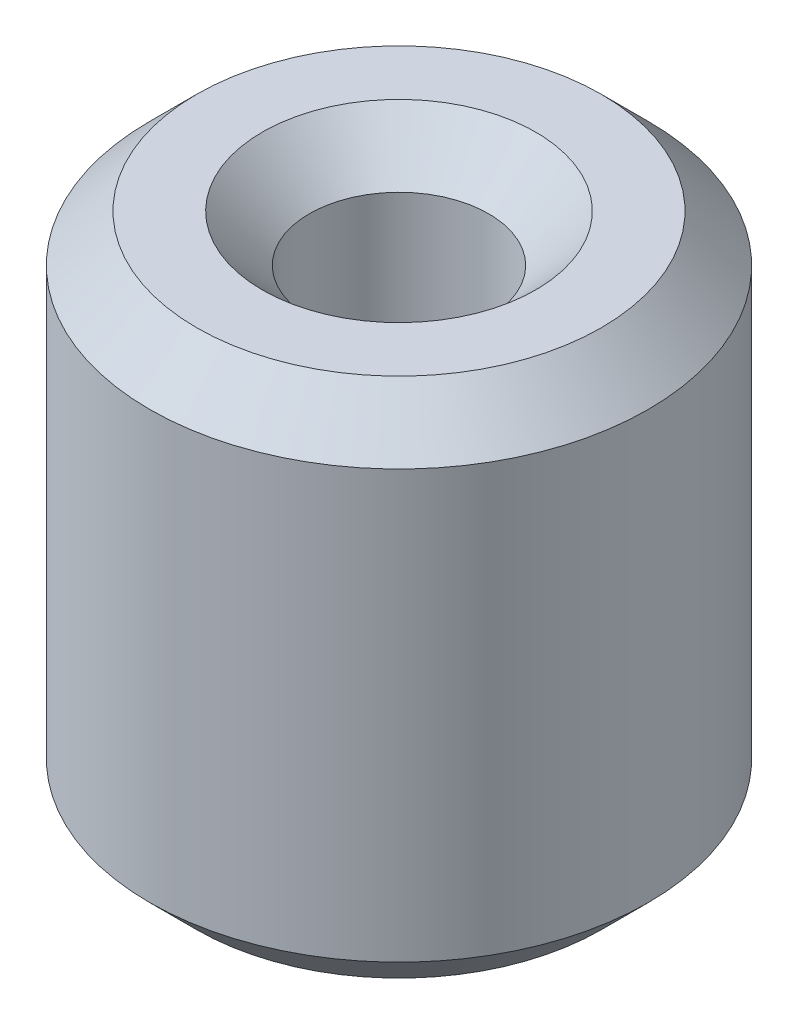
ISO-10303-21;
HEADER;
FILE_DESCRIPTION(('STEP AP214'),'2;1');
FILE_NAME('part.step','',(''),(''),'','','');
FILE_SCHEMA(('AUTOMOTIVE_DESIGN { 1 0 10303 214 1 1 1 1 }'));
ENDSEC;
DATA;
#1=APPLICATION_CONTEXT('core data for automotive mechanical design processes');
#2=APPLICATION_PROTOCOL_DEFINITION('international standard','automotive_design',2000,#1);
#3=PRODUCT_CONTEXT('',#1,'mechanical');
#4=PRODUCT('Part','Part','',(#3));
#5=PRODUCT_RELATED_PRODUCT_CATEGORY('part','',(#4));
#6=PRODUCT_DEFINITION_FORMATION('','',#4);
#7=PRODUCT_DEFINITION_CONTEXT('part definition',#1,'design');
#8=PRODUCT_DEFINITION('design','',#6,#7);
#9=PRODUCT_DEFINITION_SHAPE('','',#8);
#10=(LENGTH_UNIT() NAMED_UNIT(*) SI_UNIT(.MILLI.,.METRE.));
#11=(NAMED_UNIT(*) PLANE_ANGLE_UNIT() SI_UNIT($,.RADIAN.));
#12=(NAMED_UNIT(*) SI_UNIT($,.STERADIAN.) SOLID_ANGLE_UNIT());
#13=UNCERTAINTY_MEASURE_WITH_UNIT(LENGTH_MEASURE(1.E-05),#10,'distance_accuracy_value','');
#14=(GEOMETRIC_REPRESENTATION_CONTEXT(3) GLOBAL_UNCERTAINTY_ASSIGNED_CONTEXT((#13)) GLOBAL_UNIT_ASSIGNED_CONTEXT((#10,
#11,#12)) REPRESENTATION_CONTEXT('',''));
#15=CARTESIAN_POINT('',(0.,0.,0.));
#16=DIRECTION('',(0.,0.,1.));
#17=DIRECTION('',(1.,0.,0.));
#18=AXIS2_PLACEMENT_3D('',#15,#16,#17);
#19=CARTESIAN_POINT('',(0.,20.9052138757067,0.));
#20=DIRECTION('',(0.,-1.,0.));
#21=DIRECTION('',(0.,0.,-1.));
#22=AXIS2_PLACEMENT_3D('',#19,#20,#21);
#23=CYLINDRICAL_SURFACE('',#22,10.);
#24=CARTESIAN_POINT('',(0.,1.88904511350222,0.));
#25=DIRECTION('',(0.,1.,0.));
#26=DIRECTION('',(0.,0.,1.));
#27=AXIS2_PLACEMENT_3D('',#24,#25,#26);
#28=CIRCLE('',#27,10.);
#29=CARTESIAN_POINT('',(0.,1.88904511350222,10.));
#30=VERTEX_POINT('',#29);
#31=EDGE_CURVE('E10',#30,#30,#28,.T.);
#32=ORIENTED_EDGE('',*,*,#31,.T.);
#33=EDGE_LOOP('',(#32));
#34=FACE_BOUND('',#33,.T.);
#35=CARTESIAN_POINT('',(0.,19.0161687622044,0.));
#36=DIRECTION('',(0.,1.,0.));
#37=DIRECTION('',(0.,0.,1.));
#38=AXIS2_PLACEMENT_3D('',#35,#36,#37);
#39=CIRCLE('',#38,10.);
#40=CARTESIAN_POINT('',(0.,19.0161687622044,-10.));
#41=VERTEX_POINT('',#40);
#42=EDGE_CURVE('E50',#41,#41,#39,.F.);
#43=ORIENTED_EDGE('',*,*,#42,.T.);
#44=EDGE_LOOP('',(#43));
#45=FACE_BOUND('',#44,.T.);
#46=ADVANCED_FACE('F39',(#34,#45),#23,.T.);
#47=CARTESIAN_POINT('',(0.,20.9052138757067,0.));
#48=DIRECTION('',(0.,1.,0.));
#49=DIRECTION('',(0.,0.,1.));
#50=AXIS2_PLACEMENT_3D('',#47,#48,#49);
#51=PLANE('',#50);
#52=CARTESIAN_POINT('',(0.,20.9052138757067,0.));
#53=DIRECTION('',(0.,1.,0.));
#54=DIRECTION('',(0.,0.,1.));
#55=AXIS2_PLACEMENT_3D('',#52,#53,#54);
#56=CIRCLE('',#55,5.48269307298331);
#57=CARTESIAN_POINT('',(0.,20.9052138757067,5.48269307298331));
#58=VERTEX_POINT('',#57);
#59=EDGE_CURVE('E58',#58,#58,#56,.F.);
#60=ORIENTED_EDGE('',*,*,#59,.T.);
#61=EDGE_LOOP('',(#60));
#62=FACE_BOUND('',#61,.T.);
#63=CARTESIAN_POINT('',(0.,20.9052138757067,0.));
#64=DIRECTION('',(0.,1.,0.));
#65=DIRECTION('',(0.,0.,1.));
#66=AXIS2_PLACEMENT_3D('',#63,#64,#65);
#67=CIRCLE('',#66,8.11095488649778);
#68=CARTESIAN_POINT('',(0.,20.9052138757066,-8.11095488649779));
#69=VERTEX_POINT('',#68);
#70=EDGE_CURVE('E61',#69,#69,#67,.T.);
#71=ORIENTED_EDGE('',*,*,#70,.T.);
#72=EDGE_LOOP('',(#71));
#73=FACE_BOUND('',#72,.T.);
#74=ADVANCED_FACE('F88',(#62,#73),#51,.T.);
#75=CARTESIAN_POINT('',(0.,0.,0.));
#76=DIRECTION('',(0.,1.,0.));
#77=DIRECTION('',(0.,0.,1.));
#78=AXIS2_PLACEMENT_3D('',#75,#76,#77);
#79=PLANE('',#78);
#80=CARTESIAN_POINT('',(0.,0.,0.));
#81=DIRECTION('',(0.,1.,0.));
#82=DIRECTION('',(0.,0.,1.));
#83=AXIS2_PLACEMENT_3D('',#80,#81,#82);
#84=CIRCLE('',#83,5.4826930729833);
#85=CARTESIAN_POINT('',(0.,0.,5.4826930729833));
#86=VERTEX_POINT('',#85);
#87=EDGE_CURVE('E51',#86,#86,#84,.T.);
#88=ORIENTED_EDGE('',*,*,#87,.T.);
#89=EDGE_LOOP('',(#88));
#90=FACE_BOUND('',#89,.T.);
#91=CARTESIAN_POINT('',(0.,0.,0.));
#92=DIRECTION('',(0.,1.,0.));
#93=DIRECTION('',(0.,0.,1.));
#94=AXIS2_PLACEMENT_3D('',#91,#92,#93);
#95=CIRCLE('',#94,8.11095488649777);
#96=CARTESIAN_POINT('',(0.,0.,8.11095488649777));
#97=VERTEX_POINT('',#96);
#98=EDGE_CURVE('E54',#97,#97,#95,.F.);
#99=ORIENTED_EDGE('',*,*,#98,.T.);
#100=EDGE_LOOP('',(#99));
#101=FACE_BOUND('',#100,.T.);
#102=ADVANCED_FACE('F83',(#90,#101),#79,.F.);
#103=CARTESIAN_POINT('',(0.,20.9052138757067,0.));
#104=DIRECTION('',(0.,-1.,0.));
#105=DIRECTION('',(0.,0.,-1.));
#106=AXIS2_PLACEMENT_3D('',#103,#104,#105);
#107=CYLINDRICAL_SURFACE('',#106,3.59364795948108);
#108=CARTESIAN_POINT('',(0.,19.0161687622044,0.));
#109=DIRECTION('',(0.,1.,0.));
#110=DIRECTION('',(0.,0.,1.));
#111=AXIS2_PLACEMENT_3D('',#108,#109,#110);
#112=CIRCLE('',#111,3.59364795948108);
#113=CARTESIAN_POINT('',(0.,19.0161687622044,3.59364795948107));
#114=VERTEX_POINT('',#113);
#115=EDGE_CURVE('E67',#114,#114,#112,.T.);
#116=ORIENTED_EDGE('',*,*,#115,.T.);
#117=EDGE_LOOP('',(#116));
#118=FACE_BOUND('',#117,.T.);
#119=CARTESIAN_POINT('',(0.,1.88904511350223,0.));
#120=DIRECTION('',(0.,1.,0.));
#121=DIRECTION('',(0.,0.,1.));
#122=AXIS2_PLACEMENT_3D('',#119,#120,#121);
#123=CIRCLE('',#122,3.59364795948108);
#124=CARTESIAN_POINT('',(0.,1.88904511350223,3.59364795948108));
#125=VERTEX_POINT('',#124);
#126=EDGE_CURVE('E69',#125,#125,#123,.F.);
#127=ORIENTED_EDGE('',*,*,#126,.T.);
#128=EDGE_LOOP('',(#127));
#129=FACE_BOUND('',#128,.T.);
#130=ADVANCED_FACE('F71',(#118,#129),#107,.F.);
#131=CARTESIAN_POINT('',(0.,19.0161687622044,0.));
#132=DIRECTION('',(0.,1.,0.));
#133=DIRECTION('',(0.,0.,1.));
#134=AXIS2_PLACEMENT_3D('',#131,#132,#133);
#135=CONICAL_SURFACE('',#134,3.59364795948108,0.785398163397452);
#136=CARTESIAN_POINT('',(0.,20.9052138757067,5.48269307298331));
#137=CARTESIAN_POINT('',(0.,20.885536322441,5.46301551971766));
#138=CARTESIAN_POINT('',(0.,20.8658587691754,5.44333796645202));
#139=CARTESIAN_POINT('',(0.,20.8265036626441,5.40398285992072));
#140=CARTESIAN_POINT('',(0.,20.8068261093784,5.38430530665507));
#141=CARTESIAN_POINT('',(0.,20.7674710028471,5.34495020012377));
#142=CARTESIAN_POINT('',(0.,20.7477934495815,5.32527264685813));
#143=CARTESIAN_POINT('',(0.,20.7084383430502,5.28591754032683));
#144=CARTESIAN_POINT('',(0.,20.6887607897845,5.26623998706118));
#145=CARTESIAN_POINT('',(0.,20.6494056832532,5.22688488052988));
#146=CARTESIAN_POINT('',(0.,20.6297281299876,5.20720732726424));
#147=CARTESIAN_POINT('',(0.,20.5903730234563,5.16785222073294));
#148=CARTESIAN_POINT('',(0.,20.5706954701906,5.14817466746729));
#149=CARTESIAN_POINT('',(0.,20.5313403636593,5.10881956093599));
#150=CARTESIAN_POINT('',(0.,20.5116628103937,5.08914200767035));
#151=CARTESIAN_POINT('',(0.,20.4723077038624,5.04978690113905));
#152=CARTESIAN_POINT('',(0.,20.4526301505967,5.0301093478734));
#153=CARTESIAN_POINT('',(0.,20.4132750440654,4.99075424134211));
#154=CARTESIAN_POINT('',(0.,20.3935974907998,4.97107668807646));
#155=CARTESIAN_POINT('',(0.,20.3542423842685,4.93172158154516));
#156=CARTESIAN_POINT('',(0.,20.3345648310029,4.91204402827951));
#157=CARTESIAN_POINT('',(0.,20.2952097244716,4.87268892174821));
#158=CARTESIAN_POINT('',(0.,20.2755321712059,4.85301136848257));
#159=CARTESIAN_POINT('',(0.,20.2361770646746,4.81365626195127));
#160=CARTESIAN_POINT('',(0.,20.216499511409,4.79397870868562));
#161=CARTESIAN_POINT('',(0.,20.1771444048777,4.75462360215433));
#162=CARTESIAN_POINT('',(0.,20.157466851612,4.73494604888868));
#163=CARTESIAN_POINT('',(0.,20.1181117450807,4.69559094235738));
#164=CARTESIAN_POINT('',(0.,20.0984341918151,4.67591338909173));
#165=CARTESIAN_POINT('',(0.,20.0590790852838,4.63655828256043));
#166=CARTESIAN_POINT('',(0.,20.0394015320181,4.61688072929479));
#167=CARTESIAN_POINT('',(0.,20.0000464254868,4.57752562276349));
#168=CARTESIAN_POINT('',(0.,19.9803688722212,4.55784806949784));
#169=CARTESIAN_POINT('',(0.,19.9410137656899,4.51849296296654));
#170=CARTESIAN_POINT('',(0.,19.9213362124242,4.4988154097009));
#171=CARTESIAN_POINT('',(0.,19.8819811058929,4.4594603031696));
#172=CARTESIAN_POINT('',(0.,19.8623035526273,4.43978274990395));
#173=CARTESIAN_POINT('',(0.,19.822948446096,4.40042764337266));
#174=CARTESIAN_POINT('',(0.,19.8032708928303,4.38075009010701));
#175=CARTESIAN_POINT('',(0.,19.7639157862991,4.34139498357571));
#176=CARTESIAN_POINT('',(0.,19.7442382330334,4.32171743031006));
#177=CARTESIAN_POINT('',(0.,19.7048831265021,4.28236232377877));
#178=CARTESIAN_POINT('',(0.,19.6852055732365,4.26268477051312));
#179=CARTESIAN_POINT('',(0.,19.6458504667052,4.22332966398182));
#180=CARTESIAN_POINT('',(0.,19.6261729134395,4.20365211071617));
#181=CARTESIAN_POINT('',(0.,19.5868178069082,4.16429700418488));
#182=CARTESIAN_POINT('',(0.,19.5671402536426,4.14461945091923));
#183=CARTESIAN_POINT('',(0.,19.5277851471113,4.10526434438793));
#184=CARTESIAN_POINT('',(0.,19.5081075938456,4.08558679112228));
#185=CARTESIAN_POINT('',(0.,19.4687524873143,4.04623168459099));
#186=CARTESIAN_POINT('',(0.,19.4490749340487,4.02655413132534));
#187=CARTESIAN_POINT('',(0.,19.4097198275174,3.98719902479404));
#188=CARTESIAN_POINT('',(0.,19.3900422742517,3.96752147152839));
#189=CARTESIAN_POINT('',(0.,19.3506871677204,3.9281663649971));
#190=CARTESIAN_POINT('',(0.,19.3310096144548,3.90848881173145));
#191=CARTESIAN_POINT('',(0.,19.2916545079235,3.86913370520015));
#192=CARTESIAN_POINT('',(0.,19.2719769546578,3.8494561519345));
#193=CARTESIAN_POINT('',(0.,19.2326218481266,3.81010104540321));
#194=CARTESIAN_POINT('',(0.,19.2129442948609,3.79042349213756));
#195=CARTESIAN_POINT('',(0.,19.1735891883296,3.75106838560626));
#196=CARTESIAN_POINT('',(0.,19.153911635064,3.73139083234061));
#197=CARTESIAN_POINT('',(0.,19.1145565285327,3.69203572580932));
#198=CARTESIAN_POINT('',(0.,19.094878975267,3.67235817254367));
#199=CARTESIAN_POINT('',(0.,19.0555238687357,3.63300306601237));
#200=CARTESIAN_POINT('',(0.,19.0358463154701,3.61332551274672));
#201=CARTESIAN_POINT('',(0.,19.0161687622044,3.59364795948107));
#202=B_SPLINE_CURVE_WITH_KNOTS('',3,(#136,#137,#138,#139,#140,#141,#142,#143,#144,#145,#146,
#147,#148,#149,#150,#151,#152,#153,#154,#155,#156,#157,#158,#159,#160,#161,#162,#163,#164,#165,
#166,#167,#168,#169,#170,#171,#172,#173,#174,#175,#176,#177,#178,#179,#180,#181,#182,#183,#184,
#185,#186,#187,#188,#189,#190,#191,#192,#193,#194,#195,#196,#197,#198,#199,#200,#201),
.UNSPECIFIED.,.F.,.F.,(4,2,2,2,2,2,2,2,2,2,2,2,2,2,2,2,2,2,2,2,2,2,2,2,2,2,2,2,2,2,2,2,4),(0.,
0.0834847881077979,0.166969576215593,0.250454364323391,0.333939152431186,0.417423940538981,
0.500908728646779,0.584393516754575,0.667878304862369,0.751363092970167,0.834847881077963,
0.918332669185758,1.00181745729356,1.08530224540135,1.16878703350915,1.25227182161694,
1.33575660972474,1.41924139783254,1.50272618594033,1.58621097404813,1.66969576215592,
1.75318055026372,1.83666533837152,1.92015012647931,2.00363491458711,2.0871197026949,
2.1706044908027,2.2540892789105,2.33757406701829,2.42105885512609,2.50454364323389,
2.58802843134168,2.67151321944948),.UNSPECIFIED.);
#203=EDGE_CURVE('BSEAM77',#58,#114,#202,.T.);
#204=ORIENTED_EDGE('',*,*,#59,.F.);
#205=ORIENTED_EDGE('',*,*,#115,.F.);
#206=ORIENTED_EDGE('',*,*,#203,.T.);
#207=ORIENTED_EDGE('',*,*,#203,.F.);
#208=EDGE_LOOP('',(#204,#206,#205,#207));
#209=FACE_BOUND('',#208,.T.);
#210=ADVANCED_FACE('F77',(#209),#135,.F.);
#211=CARTESIAN_POINT('',(0.,0.,0.));
#212=DIRECTION('',(0.,-1.,0.));
#213=DIRECTION('',(0.,0.,-1.));
#214=AXIS2_PLACEMENT_3D('',#211,#212,#213);
#215=CONICAL_SURFACE('',#214,5.4826930729833,0.785398163397446);
#216=ORIENTED_EDGE('',*,*,#126,.F.);
#217=EDGE_LOOP('',(#216));
#218=FACE_BOUND('',#217,.T.);
#219=ORIENTED_EDGE('',*,*,#87,.F.);
#220=EDGE_LOOP('',(#219));
#221=FACE_BOUND('',#220,.T.);
#222=ADVANCED_FACE('F73',(#218,#221),#215,.F.);
#223=CARTESIAN_POINT('',(0.,1.88904511350222,0.));
#224=DIRECTION('',(0.,1.,0.));
#225=DIRECTION('',(0.,0.,1.));
#226=AXIS2_PLACEMENT_3D('',#223,#224,#225);
#227=CONICAL_SURFACE('',#226,10.,0.785398163397451);
#228=ORIENTED_EDGE('',*,*,#98,.F.);
#229=EDGE_LOOP('',(#228));
#230=FACE_BOUND('',#229,.T.);
#231=ORIENTED_EDGE('',*,*,#31,.F.);
#232=EDGE_LOOP('',(#231));
#233=FACE_BOUND('',#232,.T.);
#234=ADVANCED_FACE('F76',(#230,#233),#227,.T.);
#235=CARTESIAN_POINT('',(0.,20.9052138757067,0.));
#236=DIRECTION('',(0.,-1.,0.));
#237=DIRECTION('',(0.,0.,-1.));
#238=AXIS2_PLACEMENT_3D('',#235,#236,#237);
#239=CONICAL_SURFACE('',#238,8.11095488649778,0.785398163397447);
#240=CARTESIAN_POINT('',(0.,19.0161687622044,-10.));
#241=CARTESIAN_POINT('',(0.,19.0358463154701,-9.98032244673436));
#242=CARTESIAN_POINT('',(0.,19.0555238687357,-9.96064489346871));
#243=CARTESIAN_POINT('',(0.,19.094878975267,-9.92128978693741));
#244=CARTESIAN_POINT('',(0.,19.1145565285327,-9.90161223367176));
#245=CARTESIAN_POINT('',(0.,19.153911635064,-9.86225712714047));
#246=CARTESIAN_POINT('',(0.,19.1735891883296,-9.84257957387482));
#247=CARTESIAN_POINT('',(0.,19.2129442948609,-9.80322446734352));
#248=CARTESIAN_POINT('',(0.,19.2326218481266,-9.78354691407788));
#249=CARTESIAN_POINT('',(0.,19.2719769546578,-9.74419180754658));
#250=CARTESIAN_POINT('',(0.,19.2916545079235,-9.72451425428093));
#251=CARTESIAN_POINT('',(0.,19.3310096144548,-9.68515914774963));
#252=CARTESIAN_POINT('',(0.,19.3506871677204,-9.66548159448399));
#253=CARTESIAN_POINT('',(0.,19.3900422742517,-9.62612648795269));
#254=CARTESIAN_POINT('',(0.,19.4097198275174,-9.60644893468704));
#255=CARTESIAN_POINT('',(0.,19.4490749340487,-9.56709382815575));
#256=CARTESIAN_POINT('',(0.,19.4687524873143,-9.5474162748901));
#257=CARTESIAN_POINT('',(0.,19.5081075938456,-9.5080611683588));
#258=CARTESIAN_POINT('',(0.,19.5277851471113,-9.48838361509315));
#259=CARTESIAN_POINT('',(0.,19.5671402536426,-9.44902850856186));
#260=CARTESIAN_POINT('',(0.,19.5868178069082,-9.42935095529621));
#261=CARTESIAN_POINT('',(0.,19.6261729134395,-9.38999584876491));
#262=CARTESIAN_POINT('',(0.,19.6458504667052,-9.37031829549927));
#263=CARTESIAN_POINT('',(0.,19.6852055732365,-9.33096318896797));
#264=CARTESIAN_POINT('',(0.,19.7048831265021,-9.31128563570232));
#265=CARTESIAN_POINT('',(0.,19.7442382330334,-9.27193052917102));
#266=CARTESIAN_POINT('',(0.,19.7639157862991,-9.25225297590538));
#267=CARTESIAN_POINT('',(0.,19.8032708928303,-9.21289786937408));
#268=CARTESIAN_POINT('',(0.,19.822948446096,-9.19322031610843));
#269=CARTESIAN_POINT('',(0.,19.8623035526273,-9.15386520957714));
#270=CARTESIAN_POINT('',(0.,19.8819811058929,-9.13418765631149));
#271=CARTESIAN_POINT('',(0.,19.9213362124242,-9.09483254978019));
#272=CARTESIAN_POINT('',(0.,19.9410137656899,-9.07515499651454));
#273=CARTESIAN_POINT('',(0.,19.9803688722212,-9.03579988998325));
#274=CARTESIAN_POINT('',(0.,20.0000464254868,-9.0161223367176));
#275=CARTESIAN_POINT('',(0.,20.0394015320181,-8.9767672301863));
#276=CARTESIAN_POINT('',(0.,20.0590790852838,-8.95708967692066));
#277=CARTESIAN_POINT('',(0.,20.0984341918151,-8.91773457038936));
#278=CARTESIAN_POINT('',(0.,20.1181117450807,-8.89805701712371));
#279=CARTESIAN_POINT('',(0.,20.157466851612,-8.85870191059241));
#280=CARTESIAN_POINT('',(0.,20.1771444048777,-8.83902435732677));
#281=CARTESIAN_POINT('',(0.,20.216499511409,-8.79966925079547));
#282=CARTESIAN_POINT('',(0.,20.2361770646746,-8.77999169752982));
#283=CARTESIAN_POINT('',(0.,20.2755321712059,-8.74063659099853));
#284=CARTESIAN_POINT('',(0.,20.2952097244716,-8.72095903773288));
#285=CARTESIAN_POINT('',(0.,20.3345648310029,-8.68160393120158));
#286=CARTESIAN_POINT('',(0.,20.3542423842685,-8.66192637793593));
#287=CARTESIAN_POINT('',(0.,20.3935974907998,-8.62257127140464));
#288=CARTESIAN_POINT('',(0.,20.4132750440654,-8.60289371813899));
#289=CARTESIAN_POINT('',(0.,20.4526301505967,-8.56353861160769));
#290=CARTESIAN_POINT('',(0.,20.4723077038624,-8.54386105834205));
#291=CARTESIAN_POINT('',(0.,20.5116628103937,-8.50450595181075));
#292=CARTESIAN_POINT('',(0.,20.5313403636593,-8.4848283985451));
#293=CARTESIAN_POINT('',(0.,20.5706954701906,-8.4454732920138));
#294=CARTESIAN_POINT('',(0.,20.5903730234563,-8.42579573874816));
#295=CARTESIAN_POINT('',(0.,20.6297281299876,-8.38644063221686));
#296=CARTESIAN_POINT('',(0.,20.6494056832532,-8.36676307895121));
#297=CARTESIAN_POINT('',(0.,20.6887607897845,-8.32740797241992));
#298=CARTESIAN_POINT('',(0.,20.7084383430502,-8.30773041915427));
#299=CARTESIAN_POINT('',(0.,20.7477934495815,-8.26837531262297));
#300=CARTESIAN_POINT('',(0.,20.7674710028471,-8.24869775935732));
#301=CARTESIAN_POINT('',(0.,20.8068261093784,-8.20934265282603));
#302=CARTESIAN_POINT('',(0.,20.8265036626441,-8.18966509956038));
#303=CARTESIAN_POINT('',(0.,20.8658587691754,-8.15030999302908));
#304=CARTESIAN_POINT('',(0.,20.885536322441,-8.13063243976343));
#305=CARTESIAN_POINT('',(0.,20.9052138757067,-8.11095488649779));
#306=B_SPLINE_CURVE_WITH_KNOTS('',3,(#240,#241,#242,#243,#244,#245,#246,#247,#248,#249,#250,
#251,#252,#253,#254,#255,#256,#257,#258,#259,#260,#261,#262,#263,#264,#265,#266,#267,#268,#269,
#270,#271,#272,#273,#274,#275,#276,#277,#278,#279,#280,#281,#282,#283,#284,#285,#286,#287,#288,
#289,#290,#291,#292,#293,#294,#295,#296,#297,#298,#299,#300,#301,#302,#303,#304,#305),
.UNSPECIFIED.,.F.,.F.,(4,2,2,2,2,2,2,2,2,2,2,2,2,2,2,2,2,2,2,2,2,2,2,2,2,2,2,2,2,2,2,2,4),(0.,
0.0834847881077966,0.166969576215592,0.250454364323389,0.333939152431184,0.417423940538979,
0.500908728646776,0.584393516754572,0.667878304862366,0.751363092970164,0.834847881077958,
0.918332669185753,1.00181745729355,1.08530224540135,1.16878703350914,1.25227182161694,
1.33575660972473,1.41924139783253,1.50272618594032,1.58621097404812,1.66969576215591,
1.75318055026371,1.83666533837151,1.9201501264793,2.0036349145871,2.08711970269489,
2.17060449080269,2.25408927891049,2.33757406701828,2.42105885512608,2.50454364323387,
2.58802843134167,2.67151321944947),.UNSPECIFIED.);
#307=EDGE_CURVE('BSEAM45',#41,#69,#306,.T.);
#308=ORIENTED_EDGE('',*,*,#42,.F.);
#309=ORIENTED_EDGE('',*,*,#70,.F.);
#310=ORIENTED_EDGE('',*,*,#307,.T.);
#311=ORIENTED_EDGE('',*,*,#307,.F.);
#312=EDGE_LOOP('',(#308,#310,#309,#311));
#313=FACE_BOUND('',#312,.T.);
#314=ADVANCED_FACE('F45',(#313),#239,.T.);
#315=CLOSED_SHELL('',(#46,#74,#102,#130,#210,#222,#234,#314));
#316=MANIFOLD_SOLID_BREP('B2',#315);
#317=ADVANCED_BREP_SHAPE_REPRESENTATION('',(#18,#316),#14);
#318=SHAPE_DEFINITION_REPRESENTATION(#9,#317);
ENDSEC;
END-ISO-10303-21;
